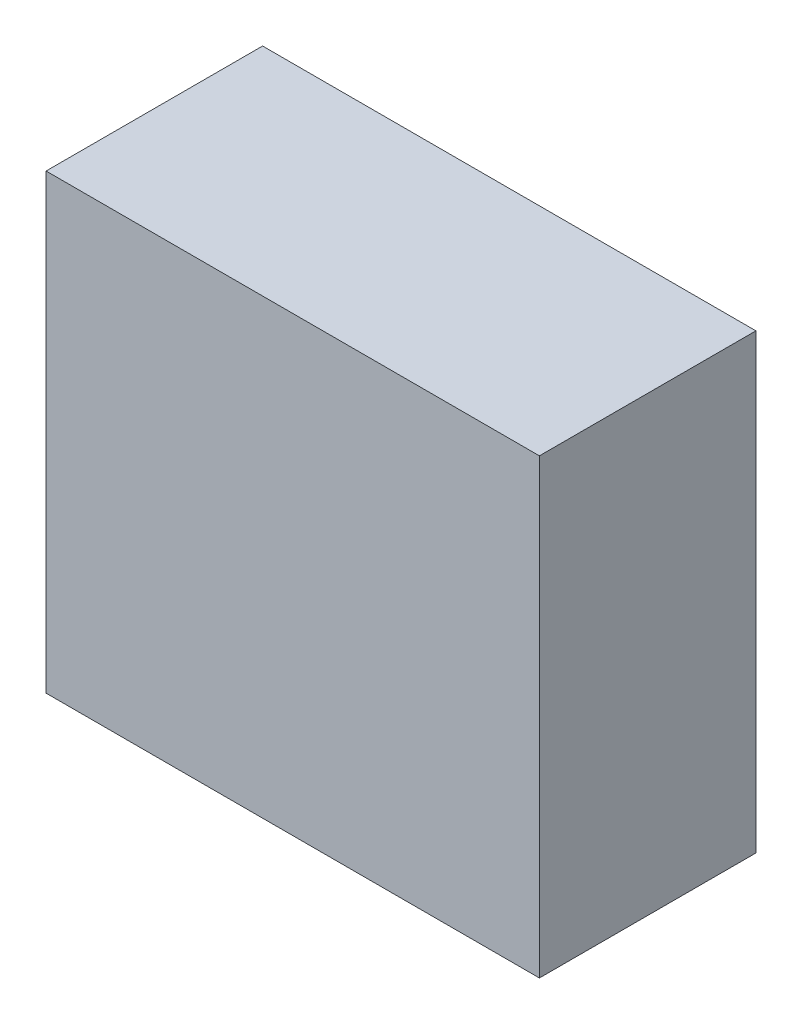
ISO-10303-21;
HEADER;
FILE_DESCRIPTION(('STEP AP214'),'2;1');
FILE_NAME('part.step','',(''),(''),'','','');
FILE_SCHEMA(('AUTOMOTIVE_DESIGN { 1 0 10303 214 1 1 1 1 }'));
ENDSEC;
DATA;
#1=APPLICATION_CONTEXT('core data for automotive mechanical design processes');
#2=APPLICATION_PROTOCOL_DEFINITION('international standard','automotive_design',2000,#1);
#3=PRODUCT_CONTEXT('',#1,'mechanical');
#4=PRODUCT('Part','Part','',(#3));
#5=PRODUCT_RELATED_PRODUCT_CATEGORY('part','',(#4));
#6=PRODUCT_DEFINITION_FORMATION('','',#4);
#7=PRODUCT_DEFINITION_CONTEXT('part definition',#1,'design');
#8=PRODUCT_DEFINITION('design','',#6,#7);
#9=PRODUCT_DEFINITION_SHAPE('','',#8);
#10=(LENGTH_UNIT() NAMED_UNIT(*) SI_UNIT(.MILLI.,.METRE.));
#11=(NAMED_UNIT(*) PLANE_ANGLE_UNIT() SI_UNIT($,.RADIAN.));
#12=(NAMED_UNIT(*) SI_UNIT($,.STERADIAN.) SOLID_ANGLE_UNIT());
#13=UNCERTAINTY_MEASURE_WITH_UNIT(LENGTH_MEASURE(1.E-05),#10,'distance_accuracy_value','');
#14=(GEOMETRIC_REPRESENTATION_CONTEXT(3) GLOBAL_UNCERTAINTY_ASSIGNED_CONTEXT((#13)) GLOBAL_UNIT_ASSIGNED_CONTEXT((#10,
#11,#12)) REPRESENTATION_CONTEXT('',''));
#15=CARTESIAN_POINT('',(0.,0.,0.));
#16=DIRECTION('',(0.,0.,1.));
#17=DIRECTION('',(1.,0.,0.));
#18=AXIS2_PLACEMENT_3D('',#15,#16,#17);
#19=CARTESIAN_POINT('',(18.,-16.5,15.8));
#20=DIRECTION('',(-1.,0.,0.));
#21=DIRECTION('',(0.,0.,1.));
#22=AXIS2_PLACEMENT_3D('',#19,#20,#21);
#23=PLANE('',#22);
#24=DIRECTION('',(0.,1.,0.));
#25=VECTOR('',#24,1.);
#26=CARTESIAN_POINT('',(18.,-16.5,0.));
#27=LINE('',#26,#25);
#28=CARTESIAN_POINT('',(18.,-16.5,0.));
#29=VERTEX_POINT('',#28);
#30=CARTESIAN_POINT('',(18.,16.5,0.));
#31=VERTEX_POINT('',#30);
#32=EDGE_CURVE('E107',#29,#31,#27,.T.);
#33=ORIENTED_EDGE('',*,*,#32,.T.);
#34=DIRECTION('',(0.,0.,-1.));
#35=VECTOR('',#34,1.);
#36=CARTESIAN_POINT('',(18.,16.5,15.8));
#37=LINE('',#36,#35);
#38=CARTESIAN_POINT('',(18.,16.5,15.8));
#39=VERTEX_POINT('',#38);
#40=EDGE_CURVE('E11',#39,#31,#37,.T.);
#41=ORIENTED_EDGE('',*,*,#40,.F.);
#42=DIRECTION('',(0.,1.,0.));
#43=VECTOR('',#42,1.);
#44=CARTESIAN_POINT('',(18.,-16.5,15.8));
#45=LINE('',#44,#43);
#46=CARTESIAN_POINT('',(18.,-16.5,15.8));
#47=VERTEX_POINT('',#46);
#48=EDGE_CURVE('E91',#47,#39,#45,.T.);
#49=ORIENTED_EDGE('',*,*,#48,.F.);
#50=DIRECTION('',(0.,0.,-1.));
#51=VECTOR('',#50,1.);
#52=CARTESIAN_POINT('',(18.,-16.5,15.8));
#53=LINE('',#52,#51);
#54=EDGE_CURVE('E103',#47,#29,#53,.T.);
#55=ORIENTED_EDGE('',*,*,#54,.T.);
#56=EDGE_LOOP('',(#33,#41,#49,#55));
#57=FACE_BOUND('',#56,.T.);
#58=ADVANCED_FACE('F39',(#57),#23,.F.);
#59=CARTESIAN_POINT('',(-18.,16.5,15.8));
#60=DIRECTION('',(0.,-1.,0.));
#61=DIRECTION('',(0.,0.,-1.));
#62=AXIS2_PLACEMENT_3D('',#59,#60,#61);
#63=PLANE('',#62);
#64=DIRECTION('',(-1.,0.,0.));
#65=VECTOR('',#64,1.);
#66=CARTESIAN_POINT('',(-18.,16.5,0.));
#67=LINE('',#66,#65);
#68=CARTESIAN_POINT('',(-18.,16.5,0.));
#69=VERTEX_POINT('',#68);
#70=EDGE_CURVE('E96',#31,#69,#67,.T.);
#71=ORIENTED_EDGE('',*,*,#70,.T.);
#72=DIRECTION('',(0.,0.,-1.));
#73=VECTOR('',#72,1.);
#74=CARTESIAN_POINT('',(-18.,16.5,15.8));
#75=LINE('',#74,#73);
#76=CARTESIAN_POINT('',(-18.,16.5,15.8));
#77=VERTEX_POINT('',#76);
#78=EDGE_CURVE('E48',#77,#69,#75,.T.);
#79=ORIENTED_EDGE('',*,*,#78,.F.);
#80=DIRECTION('',(-1.,0.,0.));
#81=VECTOR('',#80,1.);
#82=CARTESIAN_POINT('',(-18.,16.5,15.8));
#83=LINE('',#82,#81);
#84=EDGE_CURVE('E86',#39,#77,#83,.T.);
#85=ORIENTED_EDGE('',*,*,#84,.F.);
#86=ORIENTED_EDGE('',*,*,#40,.T.);
#87=EDGE_LOOP('',(#71,#79,#85,#86));
#88=FACE_BOUND('',#87,.T.);
#89=ADVANCED_FACE('F95',(#88),#63,.F.);
#90=CARTESIAN_POINT('',(-18.,-16.5,15.8));
#91=DIRECTION('',(1.,0.,0.));
#92=DIRECTION('',(0.,0.,-1.));
#93=AXIS2_PLACEMENT_3D('',#90,#91,#92);
#94=PLANE('',#93);
#95=DIRECTION('',(0.,-1.,0.));
#96=VECTOR('',#95,1.);
#97=CARTESIAN_POINT('',(-18.,-16.5,0.));
#98=LINE('',#97,#96);
#99=CARTESIAN_POINT('',(-18.,-16.5,0.));
#100=VERTEX_POINT('',#99);
#101=EDGE_CURVE('E73',#69,#100,#98,.T.);
#102=ORIENTED_EDGE('',*,*,#101,.T.);
#103=DIRECTION('',(0.,0.,-1.));
#104=VECTOR('',#103,1.);
#105=CARTESIAN_POINT('',(-18.,-16.5,15.8));
#106=LINE('',#105,#104);
#107=CARTESIAN_POINT('',(-18.,-16.5,15.8));
#108=VERTEX_POINT('',#107);
#109=EDGE_CURVE('E98',#108,#100,#106,.T.);
#110=ORIENTED_EDGE('',*,*,#109,.F.);
#111=DIRECTION('',(0.,-1.,0.));
#112=VECTOR('',#111,1.);
#113=CARTESIAN_POINT('',(-18.,-16.5,15.8));
#114=LINE('',#113,#112);
#115=EDGE_CURVE('E89',#77,#108,#114,.T.);
#116=ORIENTED_EDGE('',*,*,#115,.F.);
#117=ORIENTED_EDGE('',*,*,#78,.T.);
#118=EDGE_LOOP('',(#102,#110,#116,#117));
#119=FACE_BOUND('',#118,.T.);
#120=ADVANCED_FACE('F99',(#119),#94,.F.);
#121=CARTESIAN_POINT('',(-18.,-16.5,15.8));
#122=DIRECTION('',(0.,1.,0.));
#123=DIRECTION('',(0.,0.,1.));
#124=AXIS2_PLACEMENT_3D('',#121,#122,#123);
#125=PLANE('',#124);
#126=DIRECTION('',(1.,0.,0.));
#127=VECTOR('',#126,1.);
#128=CARTESIAN_POINT('',(-18.,-16.5,0.));
#129=LINE('',#128,#127);
#130=EDGE_CURVE('E79',#100,#29,#129,.T.);
#131=ORIENTED_EDGE('',*,*,#130,.T.);
#132=ORIENTED_EDGE('',*,*,#54,.F.);
#133=DIRECTION('',(1.,0.,0.));
#134=VECTOR('',#133,1.);
#135=CARTESIAN_POINT('',(-18.,-16.5,15.8));
#136=LINE('',#135,#134);
#137=EDGE_CURVE('E56',#108,#47,#136,.T.);
#138=ORIENTED_EDGE('',*,*,#137,.F.);
#139=ORIENTED_EDGE('',*,*,#109,.T.);
#140=EDGE_LOOP('',(#131,#132,#138,#139));
#141=FACE_BOUND('',#140,.T.);
#142=ADVANCED_FACE('F120',(#141),#125,.F.);
#143=CARTESIAN_POINT('',(0.,0.,15.8));
#144=DIRECTION('',(0.,0.,-1.));
#145=DIRECTION('',(-1.,0.,0.));
#146=AXIS2_PLACEMENT_3D('',#143,#144,#145);
#147=PLANE('',#146);
#148=ORIENTED_EDGE('',*,*,#48,.T.);
#149=ORIENTED_EDGE('',*,*,#84,.T.);
#150=ORIENTED_EDGE('',*,*,#115,.T.);
#151=ORIENTED_EDGE('',*,*,#137,.T.);
#152=EDGE_LOOP('',(#148,#149,#150,#151));
#153=FACE_BOUND('',#152,.T.);
#154=ADVANCED_FACE('F87',(#153),#147,.F.);
#155=CARTESIAN_POINT('',(0.,0.,0.));
#156=DIRECTION('',(0.,0.,-1.));
#157=DIRECTION('',(-1.,0.,0.));
#158=AXIS2_PLACEMENT_3D('',#155,#156,#157);
#159=PLANE('',#158);
#160=ORIENTED_EDGE('',*,*,#32,.F.);
#161=ORIENTED_EDGE('',*,*,#130,.F.);
#162=ORIENTED_EDGE('',*,*,#101,.F.);
#163=ORIENTED_EDGE('',*,*,#70,.F.);
#164=EDGE_LOOP('',(#160,#161,#162,#163));
#165=FACE_BOUND('',#164,.T.);
#166=ADVANCED_FACE('F123',(#165),#159,.T.);
#167=CLOSED_SHELL('',(#58,#89,#120,#142,#154,#166));
#168=MANIFOLD_SOLID_BREP('B2',#167);
#169=ADVANCED_BREP_SHAPE_REPRESENTATION('',(#18,#168),#14);
#170=SHAPE_DEFINITION_REPRESENTATION(#9,#169);
ENDSEC;
END-ISO-10303-21;
